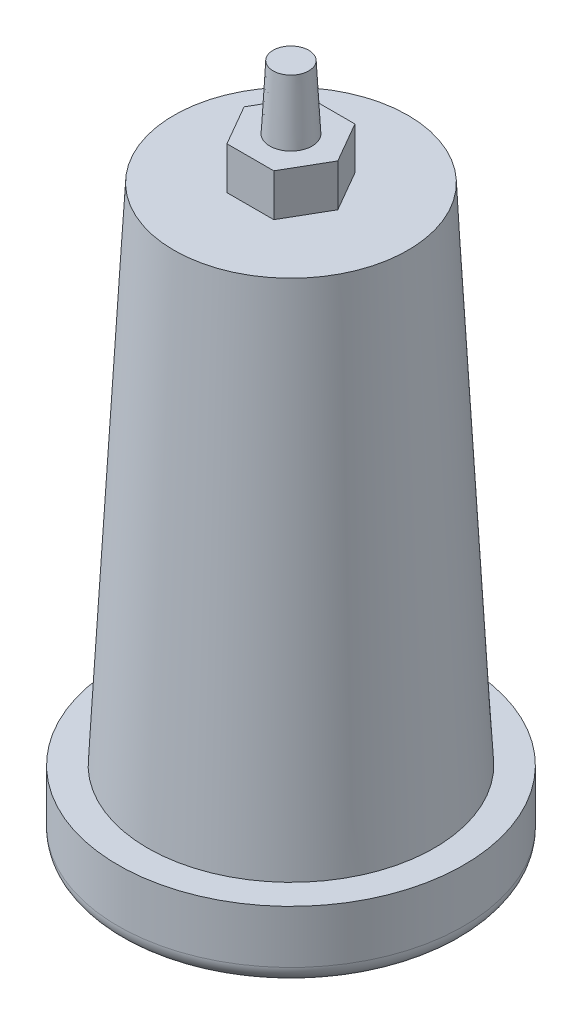
ISO-10303-21;
HEADER;
FILE_DESCRIPTION(('STEP AP214'),'2;1');
FILE_NAME('part.step','',(''),(''),'','','');
FILE_SCHEMA(('AUTOMOTIVE_DESIGN { 1 0 10303 214 1 1 1 1 }'));
ENDSEC;
DATA;
#1=APPLICATION_CONTEXT('core data for automotive mechanical design processes');
#2=APPLICATION_PROTOCOL_DEFINITION('international standard','automotive_design',2000,#1);
#3=PRODUCT_CONTEXT('',#1,'mechanical');
#4=PRODUCT('Part','Part','',(#3));
#5=PRODUCT_RELATED_PRODUCT_CATEGORY('part','',(#4));
#6=PRODUCT_DEFINITION_FORMATION('','',#4);
#7=PRODUCT_DEFINITION_CONTEXT('part definition',#1,'design');
#8=PRODUCT_DEFINITION('design','',#6,#7);
#9=PRODUCT_DEFINITION_SHAPE('','',#8);
#10=(LENGTH_UNIT() NAMED_UNIT(*) SI_UNIT(.MILLI.,.METRE.));
#11=(NAMED_UNIT(*) PLANE_ANGLE_UNIT() SI_UNIT($,.RADIAN.));
#12=(NAMED_UNIT(*) SI_UNIT($,.STERADIAN.) SOLID_ANGLE_UNIT());
#13=UNCERTAINTY_MEASURE_WITH_UNIT(LENGTH_MEASURE(1.E-05),#10,'distance_accuracy_value','');
#14=(GEOMETRIC_REPRESENTATION_CONTEXT(3) GLOBAL_UNCERTAINTY_ASSIGNED_CONTEXT((#13)) GLOBAL_UNIT_ASSIGNED_CONTEXT((#10,
#11,#12)) REPRESENTATION_CONTEXT('',''));
#15=CARTESIAN_POINT('',(0.,0.,0.));
#16=DIRECTION('',(0.,0.,1.));
#17=DIRECTION('',(1.,0.,0.));
#18=AXIS2_PLACEMENT_3D('',#15,#16,#17);
#19=CARTESIAN_POINT('',(0.,0.,0.));
#20=DIRECTION('',(0.,-1.,0.));
#21=DIRECTION('',(0.,0.,1.));
#22=AXIS2_PLACEMENT_3D('',#19,#20,#21);
#23=CONICAL_SURFACE('',#22,40.6565652443374,0.0523598775598299);
#24=CARTESIAN_POINT('',(0.,143.,0.));
#25=DIRECTION('',(0.,1.,0.));
#26=DIRECTION('',(0.,0.,1.));
#27=AXIS2_PLACEMENT_3D('',#24,#25,#26);
#28=CIRCLE('',#27,33.1622528068626);
#29=CARTESIAN_POINT('',(0.,143.,33.1622528068626));
#30=VERTEX_POINT('',#29);
#31=EDGE_CURVE('E152',#30,#30,#28,.T.);
#32=ORIENTED_EDGE('',*,*,#31,.F.);
#33=EDGE_LOOP('',(#32));
#34=FACE_BOUND('',#33,.T.);
#35=CARTESIAN_POINT('',(0.,0.,0.));
#36=DIRECTION('',(0.,-1.,0.));
#37=DIRECTION('',(0.,0.,-1.));
#38=AXIS2_PLACEMENT_3D('',#35,#36,#37);
#39=CIRCLE('',#38,40.6565652443374);
#40=CARTESIAN_POINT('',(0.,0.,-40.6565652443374));
#41=VERTEX_POINT('',#40);
#42=EDGE_CURVE('E149',#41,#41,#39,.T.);
#43=ORIENTED_EDGE('',*,*,#42,.F.);
#44=EDGE_LOOP('',(#43));
#45=FACE_BOUND('',#44,.T.);
#46=ADVANCED_FACE('F36',(#34,#45),#23,.T.);
#47=CARTESIAN_POINT('',(0.,143.,0.));
#48=DIRECTION('',(0.,1.,0.));
#49=DIRECTION('',(0.,0.,1.));
#50=AXIS2_PLACEMENT_3D('',#47,#48,#49);
#51=PLANE('',#50);
#52=DIRECTION('',(0.5,0.,-0.866025403784439));
#53=VECTOR('',#52,1.);
#54=CARTESIAN_POINT('',(-9.95929214352105,143.,-5.75));
#55=LINE('',#54,#53);
#56=CARTESIAN_POINT('',(-13.2790561913614,143.,0.));
#57=VERTEX_POINT('',#56);
#58=CARTESIAN_POINT('',(-6.6395280956807,143.,-11.5));
#59=VERTEX_POINT('',#58);
#60=EDGE_CURVE('E128',#57,#59,#55,.T.);
#61=ORIENTED_EDGE('',*,*,#60,.T.);
#62=DIRECTION('',(1.,0.,0.));
#63=VECTOR('',#62,1.);
#64=CARTESIAN_POINT('',(0.,143.,-11.5));
#65=LINE('',#64,#63);
#66=CARTESIAN_POINT('',(6.63952809568069,143.,-11.5));
#67=VERTEX_POINT('',#66);
#68=EDGE_CURVE('E94',#59,#67,#65,.T.);
#69=ORIENTED_EDGE('',*,*,#68,.T.);
#70=DIRECTION('',(0.5,0.,0.866025403784439));
#71=VECTOR('',#70,1.);
#72=CARTESIAN_POINT('',(9.95929214352104,143.,-5.75));
#73=LINE('',#72,#71);
#74=CARTESIAN_POINT('',(13.2790561913614,143.,0.));
#75=VERTEX_POINT('',#74);
#76=EDGE_CURVE('E131',#67,#75,#73,.T.);
#77=ORIENTED_EDGE('',*,*,#76,.T.);
#78=DIRECTION('',(-0.5,0.,0.866025403784439));
#79=VECTOR('',#78,1.);
#80=CARTESIAN_POINT('',(9.95929214352105,143.,5.75));
#81=LINE('',#80,#79);
#82=CARTESIAN_POINT('',(6.63952809568069,143.,11.5));
#83=VERTEX_POINT('',#82);
#84=EDGE_CURVE('E133',#75,#83,#81,.T.);
#85=ORIENTED_EDGE('',*,*,#84,.T.);
#86=DIRECTION('',(-1.,0.,0.));
#87=VECTOR('',#86,1.);
#88=CARTESIAN_POINT('',(0.,143.,11.5));
#89=LINE('',#88,#87);
#90=CARTESIAN_POINT('',(-6.6395280956807,143.,11.5));
#91=VERTEX_POINT('',#90);
#92=EDGE_CURVE('E56',#83,#91,#89,.T.);
#93=ORIENTED_EDGE('',*,*,#92,.T.);
#94=DIRECTION('',(-0.5,0.,-0.866025403784439));
#95=VECTOR('',#94,1.);
#96=CARTESIAN_POINT('',(-9.95929214352105,143.,5.75));
#97=LINE('',#96,#95);
#98=EDGE_CURVE('E51',#91,#57,#97,.T.);
#99=ORIENTED_EDGE('',*,*,#98,.T.);
#100=EDGE_LOOP('',(#61,#69,#77,#85,#93,#99));
#101=FACE_BOUND('',#100,.T.);
#102=ORIENTED_EDGE('',*,*,#31,.T.);
#103=EDGE_LOOP('',(#102));
#104=FACE_BOUND('',#103,.T.);
#105=ADVANCED_FACE('F172',(#101,#104),#51,.T.);
#106=CARTESIAN_POINT('',(0.,-20.,0.));
#107=DIRECTION('',(0.,1.,0.));
#108=DIRECTION('',(0.,0.,1.));
#109=AXIS2_PLACEMENT_3D('',#106,#107,#108);
#110=CYLINDRICAL_SURFACE('',#109,49.);
#111=CARTESIAN_POINT('',(0.,-15.,0.));
#112=DIRECTION('',(0.,-1.,0.));
#113=DIRECTION('',(0.,0.,-1.));
#114=AXIS2_PLACEMENT_3D('',#111,#112,#113);
#115=CIRCLE('',#114,49.);
#116=CARTESIAN_POINT('',(0.,-15.,-49.));
#117=VERTEX_POINT('',#116);
#118=EDGE_CURVE('E11',#117,#117,#115,.F.);
#119=ORIENTED_EDGE('',*,*,#118,.T.);
#120=EDGE_LOOP('',(#119));
#121=FACE_BOUND('',#120,.T.);
#122=CARTESIAN_POINT('',(0.,0.,0.));
#123=DIRECTION('',(0.,-1.,0.));
#124=DIRECTION('',(0.,0.,-1.));
#125=AXIS2_PLACEMENT_3D('',#122,#123,#124);
#126=CIRCLE('',#125,49.);
#127=CARTESIAN_POINT('',(0.,0.,-49.));
#128=VERTEX_POINT('',#127);
#129=EDGE_CURVE('E137',#128,#128,#126,.T.);
#130=ORIENTED_EDGE('',*,*,#129,.T.);
#131=EDGE_LOOP('',(#130));
#132=FACE_BOUND('',#131,.T.);
#133=ADVANCED_FACE('F177',(#121,#132),#110,.T.);
#134=CARTESIAN_POINT('',(0.,-20.,0.));
#135=DIRECTION('',(0.,-1.,0.));
#136=DIRECTION('',(0.,0.,-1.));
#137=AXIS2_PLACEMENT_3D('',#134,#135,#136);
#138=PLANE('',#137);
#139=CARTESIAN_POINT('',(0.,-20.,0.));
#140=DIRECTION('',(0.,-1.,0.));
#141=DIRECTION('',(0.,0.,-1.));
#142=AXIS2_PLACEMENT_3D('',#139,#140,#141);
#143=CIRCLE('',#142,44.);
#144=CARTESIAN_POINT('',(0.,-20.,-44.));
#145=VERTEX_POINT('',#144);
#146=EDGE_CURVE('E44',#145,#145,#143,.T.);
#147=ORIENTED_EDGE('',*,*,#146,.T.);
#148=EDGE_LOOP('',(#147));
#149=FACE_BOUND('',#148,.T.);
#150=ADVANCED_FACE('F157',(#149),#138,.T.);
#151=CARTESIAN_POINT('',(0.,0.,0.));
#152=DIRECTION('',(0.,-1.,0.));
#153=DIRECTION('',(0.,0.,-1.));
#154=AXIS2_PLACEMENT_3D('',#151,#152,#153);
#155=PLANE('',#154);
#156=ORIENTED_EDGE('',*,*,#42,.T.);
#157=EDGE_LOOP('',(#156));
#158=FACE_BOUND('',#157,.T.);
#159=ORIENTED_EDGE('',*,*,#129,.F.);
#160=EDGE_LOOP('',(#159));
#161=FACE_BOUND('',#160,.T.);
#162=ADVANCED_FACE('F160',(#158,#161),#155,.F.);
#163=CARTESIAN_POINT('',(0.,-15.,0.));
#164=DIRECTION('',(0.,-1.,0.));
#165=DIRECTION('',(0.,0.,-1.));
#166=AXIS2_PLACEMENT_3D('',#163,#164,#165);
#167=TOROIDAL_SURFACE('',#166,44.,5.);
#168=ORIENTED_EDGE('',*,*,#118,.F.);
#169=EDGE_LOOP('',(#168));
#170=FACE_BOUND('',#169,.T.);
#171=ORIENTED_EDGE('',*,*,#146,.F.);
#172=EDGE_LOOP('',(#171));
#173=FACE_BOUND('',#172,.T.);
#174=ADVANCED_FACE('F38',(#170,#173),#167,.T.);
#175=CARTESIAN_POINT('',(-9.95929214352105,155.,-5.75));
#176=DIRECTION('',(-0.866025403784438,0.,-0.5));
#177=DIRECTION('',(-0.5,0.,0.866025403784439));
#178=AXIS2_PLACEMENT_3D('',#175,#176,#177);
#179=PLANE('',#178);
#180=ORIENTED_EDGE('',*,*,#60,.F.);
#181=DIRECTION('',(0.,-1.,0.));
#182=VECTOR('',#181,1.);
#183=CARTESIAN_POINT('',(-13.2790561913614,155.,0.));
#184=LINE('',#183,#182);
#185=CARTESIAN_POINT('',(-13.2790561913614,155.,0.));
#186=VERTEX_POINT('',#185);
#187=EDGE_CURVE('E113',#186,#57,#184,.T.);
#188=ORIENTED_EDGE('',*,*,#187,.F.);
#189=DIRECTION('',(0.5,0.,-0.866025403784439));
#190=VECTOR('',#189,1.);
#191=CARTESIAN_POINT('',(-9.95929214352105,155.,-5.75));
#192=LINE('',#191,#190);
#193=CARTESIAN_POINT('',(-6.6395280956807,155.,-11.5));
#194=VERTEX_POINT('',#193);
#195=EDGE_CURVE('E106',#186,#194,#192,.T.);
#196=ORIENTED_EDGE('',*,*,#195,.T.);
#197=DIRECTION('',(0.,-1.,0.));
#198=VECTOR('',#197,1.);
#199=CARTESIAN_POINT('',(-6.6395280956807,155.,-11.5));
#200=LINE('',#199,#198);
#201=EDGE_CURVE('E89',#194,#59,#200,.T.);
#202=ORIENTED_EDGE('',*,*,#201,.T.);
#203=EDGE_LOOP('',(#180,#188,#196,#202));
#204=FACE_BOUND('',#203,.T.);
#205=ADVANCED_FACE('F112',(#204),#179,.T.);
#206=CARTESIAN_POINT('',(-9.95929214352105,155.,5.75));
#207=DIRECTION('',(-0.866025403784439,0.,0.5));
#208=DIRECTION('',(0.5,0.,0.866025403784439));
#209=AXIS2_PLACEMENT_3D('',#206,#207,#208);
#210=PLANE('',#209);
#211=ORIENTED_EDGE('',*,*,#98,.F.);
#212=DIRECTION('',(0.,-1.,0.));
#213=VECTOR('',#212,1.);
#214=CARTESIAN_POINT('',(-6.6395280956807,155.,11.5));
#215=LINE('',#214,#213);
#216=CARTESIAN_POINT('',(-6.6395280956807,155.,11.5));
#217=VERTEX_POINT('',#216);
#218=EDGE_CURVE('E138',#217,#91,#215,.T.);
#219=ORIENTED_EDGE('',*,*,#218,.F.);
#220=DIRECTION('',(-0.5,0.,-0.866025403784439));
#221=VECTOR('',#220,1.);
#222=CARTESIAN_POINT('',(-9.95929214352105,155.,5.75));
#223=LINE('',#222,#221);
#224=EDGE_CURVE('E99',#217,#186,#223,.T.);
#225=ORIENTED_EDGE('',*,*,#224,.T.);
#226=ORIENTED_EDGE('',*,*,#187,.T.);
#227=EDGE_LOOP('',(#211,#219,#225,#226));
#228=FACE_BOUND('',#227,.T.);
#229=ADVANCED_FACE('F166',(#228),#210,.T.);
#230=CARTESIAN_POINT('',(0.,155.,11.5));
#231=DIRECTION('',(0.,0.,1.));
#232=DIRECTION('',(1.,0.,0.));
#233=AXIS2_PLACEMENT_3D('',#230,#231,#232);
#234=PLANE('',#233);
#235=ORIENTED_EDGE('',*,*,#92,.F.);
#236=DIRECTION('',(0.,-1.,0.));
#237=VECTOR('',#236,1.);
#238=CARTESIAN_POINT('',(6.63952809568069,155.,11.5));
#239=LINE('',#238,#237);
#240=CARTESIAN_POINT('',(6.63952809568069,155.,11.5));
#241=VERTEX_POINT('',#240);
#242=EDGE_CURVE('E140',#241,#83,#239,.T.);
#243=ORIENTED_EDGE('',*,*,#242,.F.);
#244=DIRECTION('',(-1.,0.,0.));
#245=VECTOR('',#244,1.);
#246=CARTESIAN_POINT('',(0.,155.,11.5));
#247=LINE('',#246,#245);
#248=EDGE_CURVE('E124',#241,#217,#247,.T.);
#249=ORIENTED_EDGE('',*,*,#248,.T.);
#250=ORIENTED_EDGE('',*,*,#218,.T.);
#251=EDGE_LOOP('',(#235,#243,#249,#250));
#252=FACE_BOUND('',#251,.T.);
#253=ADVANCED_FACE('F196',(#252),#234,.T.);
#254=CARTESIAN_POINT('',(9.95929214352105,155.,5.75));
#255=DIRECTION('',(0.866025403784439,0.,0.5));
#256=DIRECTION('',(0.5,0.,-0.866025403784439));
#257=AXIS2_PLACEMENT_3D('',#254,#255,#256);
#258=PLANE('',#257);
#259=ORIENTED_EDGE('',*,*,#84,.F.);
#260=DIRECTION('',(0.,-1.,0.));
#261=VECTOR('',#260,1.);
#262=CARTESIAN_POINT('',(13.2790561913614,155.,0.));
#263=LINE('',#262,#261);
#264=CARTESIAN_POINT('',(13.2790561913614,155.,0.));
#265=VERTEX_POINT('',#264);
#266=EDGE_CURVE('E143',#265,#75,#263,.T.);
#267=ORIENTED_EDGE('',*,*,#266,.F.);
#268=DIRECTION('',(-0.5,0.,0.866025403784439));
#269=VECTOR('',#268,1.);
#270=CARTESIAN_POINT('',(9.95929214352105,155.,5.75));
#271=LINE('',#270,#269);
#272=EDGE_CURVE('E121',#265,#241,#271,.T.);
#273=ORIENTED_EDGE('',*,*,#272,.T.);
#274=ORIENTED_EDGE('',*,*,#242,.T.);
#275=EDGE_LOOP('',(#259,#267,#273,#274));
#276=FACE_BOUND('',#275,.T.);
#277=ADVANCED_FACE('F192',(#276),#258,.T.);
#278=CARTESIAN_POINT('',(9.95929214352104,155.,-5.75));
#279=DIRECTION('',(0.866025403784439,0.,-0.5));
#280=DIRECTION('',(-0.5,0.,-0.866025403784439));
#281=AXIS2_PLACEMENT_3D('',#278,#279,#280);
#282=PLANE('',#281);
#283=ORIENTED_EDGE('',*,*,#76,.F.);
#284=DIRECTION('',(0.,-1.,0.));
#285=VECTOR('',#284,1.);
#286=CARTESIAN_POINT('',(6.63952809568069,155.,-11.5));
#287=LINE('',#286,#285);
#288=CARTESIAN_POINT('',(6.63952809568069,155.,-11.5));
#289=VERTEX_POINT('',#288);
#290=EDGE_CURVE('E98',#289,#67,#287,.T.);
#291=ORIENTED_EDGE('',*,*,#290,.F.);
#292=DIRECTION('',(0.5,0.,0.866025403784439));
#293=VECTOR('',#292,1.);
#294=CARTESIAN_POINT('',(9.95929214352104,155.,-5.75));
#295=LINE('',#294,#293);
#296=EDGE_CURVE('E110',#289,#265,#295,.T.);
#297=ORIENTED_EDGE('',*,*,#296,.T.);
#298=ORIENTED_EDGE('',*,*,#266,.T.);
#299=EDGE_LOOP('',(#283,#291,#297,#298));
#300=FACE_BOUND('',#299,.T.);
#301=ADVANCED_FACE('F189',(#300),#282,.T.);
#302=CARTESIAN_POINT('',(0.,155.,-11.5));
#303=DIRECTION('',(0.,0.,-1.));
#304=DIRECTION('',(-1.,0.,0.));
#305=AXIS2_PLACEMENT_3D('',#302,#303,#304);
#306=PLANE('',#305);
#307=ORIENTED_EDGE('',*,*,#68,.F.);
#308=ORIENTED_EDGE('',*,*,#201,.F.);
#309=DIRECTION('',(1.,0.,0.));
#310=VECTOR('',#309,1.);
#311=CARTESIAN_POINT('',(0.,155.,-11.5));
#312=LINE('',#311,#310);
#313=EDGE_CURVE('E93',#194,#289,#312,.T.);
#314=ORIENTED_EDGE('',*,*,#313,.T.);
#315=ORIENTED_EDGE('',*,*,#290,.T.);
#316=EDGE_LOOP('',(#307,#308,#314,#315));
#317=FACE_BOUND('',#316,.T.);
#318=ADVANCED_FACE('F91',(#317),#306,.T.);
#319=CARTESIAN_POINT('',(0.,155.,0.));
#320=DIRECTION('',(0.,-1.,0.));
#321=DIRECTION('',(0.,0.,-1.));
#322=AXIS2_PLACEMENT_3D('',#319,#320,#321);
#323=PLANE('',#322);
#324=CARTESIAN_POINT('',(0.,155.,0.));
#325=DIRECTION('',(0.,-1.,0.));
#326=DIRECTION('',(0.,0.,-1.));
#327=AXIS2_PLACEMENT_3D('',#324,#325,#326);
#328=CIRCLE('',#327,6.);
#329=CARTESIAN_POINT('',(0.,155.,-6.));
#330=VERTEX_POINT('',#329);
#331=EDGE_CURVE('E218',#330,#330,#328,.T.);
#332=ORIENTED_EDGE('',*,*,#331,.T.);
#333=EDGE_LOOP('',(#332));
#334=FACE_BOUND('',#333,.T.);
#335=ORIENTED_EDGE('',*,*,#195,.F.);
#336=ORIENTED_EDGE('',*,*,#224,.F.);
#337=ORIENTED_EDGE('',*,*,#248,.F.);
#338=ORIENTED_EDGE('',*,*,#272,.F.);
#339=ORIENTED_EDGE('',*,*,#296,.F.);
#340=ORIENTED_EDGE('',*,*,#313,.F.);
#341=EDGE_LOOP('',(#335,#336,#337,#338,#339,#340));
#342=FACE_BOUND('',#341,.T.);
#343=ADVANCED_FACE('F104',(#334,#342),#323,.F.);
#344=CARTESIAN_POINT('',(0.,155.,0.));
#345=DIRECTION('',(0.,-1.,0.));
#346=DIRECTION('',(0.,0.,-1.));
#347=AXIS2_PLACEMENT_3D('',#344,#345,#346);
#348=CONICAL_SURFACE('',#347,6.,0.0523598775598299);
#349=CARTESIAN_POINT('',(0.,173.,0.));
#350=DIRECTION('',(0.,-1.,0.));
#351=DIRECTION('',(0.,0.,-1.));
#352=AXIS2_PLACEMENT_3D('',#349,#350,#351);
#353=CIRCLE('',#352,5.05665997290526);
#354=CARTESIAN_POINT('',(0.,173.,-5.05665997290526));
#355=VERTEX_POINT('',#354);
#356=EDGE_CURVE('E117',#355,#355,#353,.T.);
#357=ORIENTED_EDGE('',*,*,#356,.T.);
#358=EDGE_LOOP('',(#357));
#359=FACE_BOUND('',#358,.T.);
#360=ORIENTED_EDGE('',*,*,#331,.F.);
#361=EDGE_LOOP('',(#360));
#362=FACE_BOUND('',#361,.T.);
#363=ADVANCED_FACE('F206',(#359,#362),#348,.T.);
#364=CARTESIAN_POINT('',(0.,173.,0.));
#365=DIRECTION('',(0.,-1.,0.));
#366=DIRECTION('',(0.,0.,-1.));
#367=AXIS2_PLACEMENT_3D('',#364,#365,#366);
#368=PLANE('',#367);
#369=ORIENTED_EDGE('',*,*,#356,.F.);
#370=EDGE_LOOP('',(#369));
#371=FACE_BOUND('',#370,.T.);
#372=ADVANCED_FACE('F210',(#371),#368,.F.);
#373=CLOSED_SHELL('',(#46,#105,#133,#150,#162,#174,#205,#229,#253,#277,#301,#318,#343,#363,#372));
#374=MANIFOLD_SOLID_BREP('B2',#373);
#375=ADVANCED_BREP_SHAPE_REPRESENTATION('',(#18,#374),#14);
#376=SHAPE_DEFINITION_REPRESENTATION(#9,#375);
ENDSEC;
END-ISO-10303-21;
